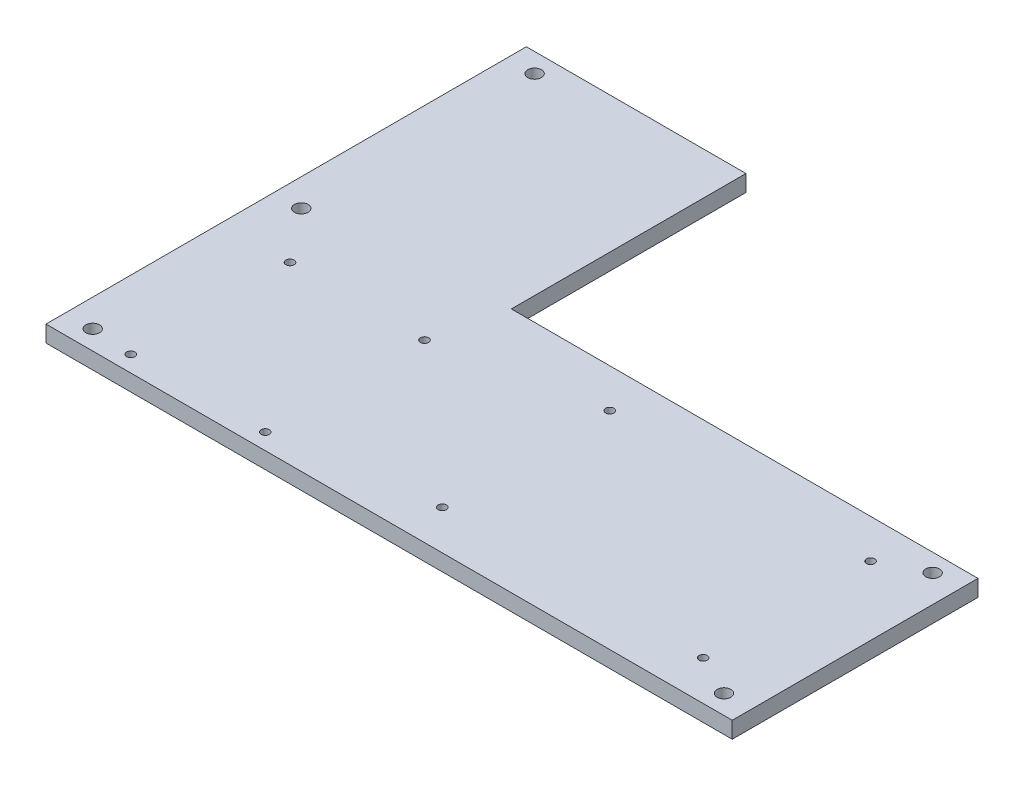
ISO-10303-21;
HEADER;
FILE_DESCRIPTION(('STEP AP214'),'2;1');
FILE_NAME('part.step','',(''),(''),'','','');
FILE_SCHEMA(('AUTOMOTIVE_DESIGN { 1 0 10303 214 1 1 1 1 }'));
ENDSEC;
DATA;
#1=APPLICATION_CONTEXT('core data for automotive mechanical design processes');
#2=APPLICATION_PROTOCOL_DEFINITION('international standard','automotive_design',2000,#1);
#3=PRODUCT_CONTEXT('',#1,'mechanical');
#4=PRODUCT('Part','Part','',(#3));
#5=PRODUCT_RELATED_PRODUCT_CATEGORY('part','',(#4));
#6=PRODUCT_DEFINITION_FORMATION('','',#4);
#7=PRODUCT_DEFINITION_CONTEXT('part definition',#1,'design');
#8=PRODUCT_DEFINITION('design','',#6,#7);
#9=PRODUCT_DEFINITION_SHAPE('','',#8);
#10=(LENGTH_UNIT() NAMED_UNIT(*) SI_UNIT(.MILLI.,.METRE.));
#11=(NAMED_UNIT(*) PLANE_ANGLE_UNIT() SI_UNIT($,.RADIAN.));
#12=(NAMED_UNIT(*) SI_UNIT($,.STERADIAN.) SOLID_ANGLE_UNIT());
#13=UNCERTAINTY_MEASURE_WITH_UNIT(LENGTH_MEASURE(1.E-05),#10,'distance_accuracy_value','');
#14=(GEOMETRIC_REPRESENTATION_CONTEXT(3) GLOBAL_UNCERTAINTY_ASSIGNED_CONTEXT((#13)) GLOBAL_UNIT_ASSIGNED_CONTEXT((#10,
#11,#12)) REPRESENTATION_CONTEXT('',''));
#15=CARTESIAN_POINT('',(0.,0.,0.));
#16=DIRECTION('',(0.,0.,1.));
#17=DIRECTION('',(1.,0.,0.));
#18=AXIS2_PLACEMENT_3D('',#15,#16,#17);
#19=CARTESIAN_POINT('',(-45.3239364575619,6.,-44.6511212594059));
#20=DIRECTION('',(0.,0.,-1.));
#21=DIRECTION('',(-1.,0.,0.));
#22=AXIS2_PLACEMENT_3D('',#19,#20,#21);
#23=PLANE('',#22);
#24=DIRECTION('',(1.,0.,0.));
#25=VECTOR('',#24,1.);
#26=CARTESIAN_POINT('',(-45.3239364575619,0.,-44.6511212594059));
#27=LINE('',#26,#25);
#28=CARTESIAN_POINT('',(-45.3239364575619,0.,-44.6511212594059));
#29=VERTEX_POINT('',#28);
#30=CARTESIAN_POINT('',(124.675630023575,0.,-44.6511212594059));
#31=VERTEX_POINT('',#30);
#32=EDGE_CURVE('E114',#29,#31,#27,.T.);
#33=ORIENTED_EDGE('',*,*,#32,.F.);
#34=DIRECTION('',(0.,-1.,0.));
#35=VECTOR('',#34,1.);
#36=CARTESIAN_POINT('',(-45.3239364575619,6.,-44.6511212594059));
#37=LINE('',#36,#35);
#38=CARTESIAN_POINT('',(-45.3239364575619,6.,-44.6511212594059));
#39=VERTEX_POINT('',#38);
#40=EDGE_CURVE('E11',#39,#29,#37,.T.);
#41=ORIENTED_EDGE('',*,*,#40,.F.);
#42=DIRECTION('',(1.,0.,0.));
#43=VECTOR('',#42,1.);
#44=CARTESIAN_POINT('',(-45.3239364575619,6.,-44.6511212594059));
#45=LINE('',#44,#43);
#46=CARTESIAN_POINT('',(124.675630023575,6.,-44.6511212594059));
#47=VERTEX_POINT('',#46);
#48=EDGE_CURVE('E129',#39,#47,#45,.T.);
#49=ORIENTED_EDGE('',*,*,#48,.T.);
#50=DIRECTION('',(0.,-1.,0.));
#51=VECTOR('',#50,1.);
#52=CARTESIAN_POINT('',(124.675630023575,6.,-44.6511212594059));
#53=LINE('',#52,#51);
#54=EDGE_CURVE('E35',#47,#31,#53,.T.);
#55=ORIENTED_EDGE('',*,*,#54,.T.);
#56=EDGE_LOOP('',(#33,#41,#49,#55));
#57=FACE_BOUND('',#56,.T.);
#58=ADVANCED_FACE('F32',(#57),#23,.T.);
#59=CARTESIAN_POINT('',(-45.323936457562,6.,-130.116695360476));
#60=DIRECTION('',(1.,0.,0.));
#61=DIRECTION('',(0.,0.,-1.));
#62=AXIS2_PLACEMENT_3D('',#59,#60,#61);
#63=PLANE('',#62);
#64=DIRECTION('',(0.,0.,1.));
#65=VECTOR('',#64,1.);
#66=CARTESIAN_POINT('',(-45.323936457562,0.,-130.116695360476));
#67=LINE('',#66,#65);
#68=CARTESIAN_POINT('',(-45.323936457562,0.,-130.116695360476));
#69=VERTEX_POINT('',#68);
#70=EDGE_CURVE('E127',#69,#29,#67,.T.);
#71=ORIENTED_EDGE('',*,*,#70,.F.);
#72=DIRECTION('',(0.,-1.,0.));
#73=VECTOR('',#72,1.);
#74=CARTESIAN_POINT('',(-45.323936457562,6.,-130.116695360476));
#75=LINE('',#74,#73);
#76=CARTESIAN_POINT('',(-45.323936457562,6.,-130.116695360476));
#77=VERTEX_POINT('',#76);
#78=EDGE_CURVE('E41',#77,#69,#75,.T.);
#79=ORIENTED_EDGE('',*,*,#78,.F.);
#80=DIRECTION('',(0.,0.,1.));
#81=VECTOR('',#80,1.);
#82=CARTESIAN_POINT('',(-45.323936457562,6.,-130.116695360476));
#83=LINE('',#82,#81);
#84=EDGE_CURVE('E109',#77,#39,#83,.T.);
#85=ORIENTED_EDGE('',*,*,#84,.T.);
#86=ORIENTED_EDGE('',*,*,#40,.T.);
#87=EDGE_LOOP('',(#71,#79,#85,#86));
#88=FACE_BOUND('',#87,.T.);
#89=ADVANCED_FACE('F138',(#88),#63,.T.);
#90=CARTESIAN_POINT('',(-125.323936457562,6.,-130.116695360476));
#91=DIRECTION('',(0.,0.,-1.));
#92=DIRECTION('',(-1.,0.,0.));
#93=AXIS2_PLACEMENT_3D('',#90,#91,#92);
#94=PLANE('',#93);
#95=DIRECTION('',(1.,0.,0.));
#96=VECTOR('',#95,1.);
#97=CARTESIAN_POINT('',(-125.323936457562,0.,-130.116695360476));
#98=LINE('',#97,#96);
#99=CARTESIAN_POINT('',(-125.323936457562,0.,-130.116695360476));
#100=VERTEX_POINT('',#99);
#101=EDGE_CURVE('E105',#100,#69,#98,.T.);
#102=ORIENTED_EDGE('',*,*,#101,.F.);
#103=DIRECTION('',(0.,-1.,0.));
#104=VECTOR('',#103,1.);
#105=CARTESIAN_POINT('',(-125.323936457562,6.,-130.116695360476));
#106=LINE('',#105,#104);
#107=CARTESIAN_POINT('',(-125.323936457562,6.,-130.116695360476));
#108=VERTEX_POINT('',#107);
#109=EDGE_CURVE('E94',#108,#100,#106,.T.);
#110=ORIENTED_EDGE('',*,*,#109,.F.);
#111=DIRECTION('',(1.,0.,0.));
#112=VECTOR('',#111,1.);
#113=CARTESIAN_POINT('',(-125.323936457562,6.,-130.116695360476));
#114=LINE('',#113,#112);
#115=EDGE_CURVE('E100',#108,#77,#114,.T.);
#116=ORIENTED_EDGE('',*,*,#115,.T.);
#117=ORIENTED_EDGE('',*,*,#78,.T.);
#118=EDGE_LOOP('',(#102,#110,#116,#117));
#119=FACE_BOUND('',#118,.T.);
#120=ADVANCED_FACE('F103',(#119),#94,.T.);
#121=CARTESIAN_POINT('',(-125.323936457562,6.,-45.1166953604762));
#122=DIRECTION('',(-1.,0.,0.));
#123=DIRECTION('',(0.,0.,1.));
#124=AXIS2_PLACEMENT_3D('',#121,#122,#123);
#125=PLANE('',#124);
#126=DIRECTION('',(0.,0.,-1.));
#127=VECTOR('',#126,1.);
#128=CARTESIAN_POINT('',(-125.323936457562,0.,-45.1166953604762));
#129=LINE('',#128,#127);
#130=CARTESIAN_POINT('',(-125.323936457562,0.,44.8833046395238));
#131=VERTEX_POINT('',#130);
#132=EDGE_CURVE('E124',#131,#100,#129,.T.);
#133=ORIENTED_EDGE('',*,*,#132,.F.);
#134=DIRECTION('',(0.,-1.,0.));
#135=VECTOR('',#134,1.);
#136=CARTESIAN_POINT('',(-125.323936457562,6.,44.8833046395238));
#137=LINE('',#136,#135);
#138=CARTESIAN_POINT('',(-125.323936457562,6.,44.8833046395238));
#139=VERTEX_POINT('',#138);
#140=EDGE_CURVE('E96',#139,#131,#137,.T.);
#141=ORIENTED_EDGE('',*,*,#140,.F.);
#142=DIRECTION('',(0.,0.,1.));
#143=VECTOR('',#142,1.);
#144=CARTESIAN_POINT('',(-125.323936457562,6.,-45.1166953604762));
#145=LINE('',#144,#143);
#146=EDGE_CURVE('E91',#108,#139,#145,.T.);
#147=ORIENTED_EDGE('',*,*,#146,.F.);
#148=ORIENTED_EDGE('',*,*,#109,.T.);
#149=EDGE_LOOP('',(#133,#141,#147,#148));
#150=FACE_BOUND('',#149,.T.);
#151=ADVANCED_FACE('F93',(#150),#125,.T.);
#152=CARTESIAN_POINT('',(-125.323936457562,6.,44.8833046395238));
#153=DIRECTION('',(0.,0.,-1.));
#154=DIRECTION('',(-1.,0.,0.));
#155=AXIS2_PLACEMENT_3D('',#152,#153,#154);
#156=PLANE('',#155);
#157=DIRECTION('',(1.,0.,0.));
#158=VECTOR('',#157,1.);
#159=CARTESIAN_POINT('',(-125.323936457562,0.,44.8833046395238));
#160=LINE('',#159,#158);
#161=CARTESIAN_POINT('',(124.675630023575,0.,44.8833046395238));
#162=VERTEX_POINT('',#161);
#163=EDGE_CURVE('E121',#131,#162,#160,.T.);
#164=ORIENTED_EDGE('',*,*,#163,.T.);
#165=DIRECTION('',(0.,-1.,0.));
#166=VECTOR('',#165,1.);
#167=CARTESIAN_POINT('',(124.675630023575,6.,44.8833046395238));
#168=LINE('',#167,#166);
#169=CARTESIAN_POINT('',(124.675630023575,6.,44.8833046395238));
#170=VERTEX_POINT('',#169);
#171=EDGE_CURVE('E132',#170,#162,#168,.T.);
#172=ORIENTED_EDGE('',*,*,#171,.F.);
#173=DIRECTION('',(1.,0.,0.));
#174=VECTOR('',#173,1.);
#175=CARTESIAN_POINT('',(-125.323936457562,6.,44.8833046395238));
#176=LINE('',#175,#174);
#177=EDGE_CURVE('E101',#139,#170,#176,.T.);
#178=ORIENTED_EDGE('',*,*,#177,.F.);
#179=ORIENTED_EDGE('',*,*,#140,.T.);
#180=EDGE_LOOP('',(#164,#172,#178,#179));
#181=FACE_BOUND('',#180,.T.);
#182=ADVANCED_FACE('F151',(#181),#156,.F.);
#183=CARTESIAN_POINT('',(124.675630023575,6.,-44.6511212594059));
#184=DIRECTION('',(1.,0.,0.));
#185=DIRECTION('',(0.,0.,-1.));
#186=AXIS2_PLACEMENT_3D('',#183,#184,#185);
#187=PLANE('',#186);
#188=DIRECTION('',(0.,0.,1.));
#189=VECTOR('',#188,1.);
#190=CARTESIAN_POINT('',(124.675630023575,0.,-44.6511212594059));
#191=LINE('',#190,#189);
#192=EDGE_CURVE('E117',#31,#162,#191,.T.);
#193=ORIENTED_EDGE('',*,*,#192,.F.);
#194=ORIENTED_EDGE('',*,*,#54,.F.);
#195=DIRECTION('',(0.,0.,1.));
#196=VECTOR('',#195,1.);
#197=CARTESIAN_POINT('',(124.675630023575,6.,-44.6511212594059));
#198=LINE('',#197,#196);
#199=EDGE_CURVE('E300',#47,#170,#198,.T.);
#200=ORIENTED_EDGE('',*,*,#199,.T.);
#201=ORIENTED_EDGE('',*,*,#171,.T.);
#202=EDGE_LOOP('',(#193,#194,#200,#201));
#203=FACE_BOUND('',#202,.T.);
#204=ADVANCED_FACE('F134',(#203),#187,.T.);
#205=CARTESIAN_POINT('',(0.,6.,0.));
#206=DIRECTION('',(0.,-1.,0.));
#207=DIRECTION('',(0.,0.,-1.));
#208=AXIS2_PLACEMENT_3D('',#205,#206,#207);
#209=PLANE('',#208);
#210=CARTESIAN_POINT('',(114.675630023575,6.,-38.1166953604762));
#211=DIRECTION('',(0.,1.,0.));
#212=DIRECTION('',(0.,0.,1.));
#213=AXIS2_PLACEMENT_3D('',#210,#211,#212);
#214=CIRCLE('',#213,2.50000000000001);
#215=CARTESIAN_POINT('',(114.675630023575,6.,-35.6166953604762));
#216=VERTEX_POINT('',#215);
#217=EDGE_CURVE('E221',#216,#216,#214,.T.);
#218=ORIENTED_EDGE('',*,*,#217,.F.);
#219=EDGE_LOOP('',(#218));
#220=FACE_BOUND('',#219,.T.);
#221=CARTESIAN_POINT('',(114.675630023575,6.,37.8833046395238));
#222=DIRECTION('',(0.,1.,0.));
#223=DIRECTION('',(0.,0.,1.));
#224=AXIS2_PLACEMENT_3D('',#221,#222,#223);
#225=CIRCLE('',#224,2.5);
#226=CARTESIAN_POINT('',(114.675630023575,6.,40.3833046395238));
#227=VERTEX_POINT('',#226);
#228=EDGE_CURVE('E225',#227,#227,#225,.T.);
#229=ORIENTED_EDGE('',*,*,#228,.F.);
#230=EDGE_LOOP('',(#229));
#231=FACE_BOUND('',#230,.T.);
#232=CARTESIAN_POINT('',(-115.323936457562,6.,37.8833046395238));
#233=DIRECTION('',(0.,1.,0.));
#234=DIRECTION('',(0.,0.,1.));
#235=AXIS2_PLACEMENT_3D('',#232,#233,#234);
#236=CIRCLE('',#235,2.50000000000001);
#237=CARTESIAN_POINT('',(-115.323936457562,6.,40.3833046395238));
#238=VERTEX_POINT('',#237);
#239=EDGE_CURVE('E233',#238,#238,#236,.T.);
#240=ORIENTED_EDGE('',*,*,#239,.F.);
#241=EDGE_LOOP('',(#240));
#242=FACE_BOUND('',#241,.T.);
#243=CARTESIAN_POINT('',(-115.323936457562,6.,-38.1166953604762));
#244=DIRECTION('',(0.,1.,0.));
#245=DIRECTION('',(0.,0.,1.));
#246=AXIS2_PLACEMENT_3D('',#243,#244,#245);
#247=CIRCLE('',#246,2.50000000000001);
#248=CARTESIAN_POINT('',(-115.323936457562,6.,-35.6166953604762));
#249=VERTEX_POINT('',#248);
#250=EDGE_CURVE('E238',#249,#249,#247,.T.);
#251=ORIENTED_EDGE('',*,*,#250,.F.);
#252=EDGE_LOOP('',(#251));
#253=FACE_BOUND('',#252,.T.);
#254=CARTESIAN_POINT('',(4.67563002357504,6.,30.5));
#255=DIRECTION('',(0.,1.,0.));
#256=DIRECTION('',(0.,0.,1.));
#257=AXIS2_PLACEMENT_3D('',#254,#255,#256);
#258=CIRCLE('',#257,1.5);
#259=CARTESIAN_POINT('',(4.67563002357504,6.,32.));
#260=VERTEX_POINT('',#259);
#261=EDGE_CURVE('E244',#260,#260,#258,.T.);
#262=ORIENTED_EDGE('',*,*,#261,.F.);
#263=EDGE_LOOP('',(#262));
#264=FACE_BOUND('',#263,.T.);
#265=CARTESIAN_POINT('',(99.6756300235751,6.,30.5));
#266=DIRECTION('',(0.,1.,0.));
#267=DIRECTION('',(0.,0.,1.));
#268=AXIS2_PLACEMENT_3D('',#265,#266,#267);
#269=CIRCLE('',#268,1.5);
#270=CARTESIAN_POINT('',(99.6756300235751,6.,32.));
#271=VERTEX_POINT('',#270);
#272=EDGE_CURVE('E250',#271,#271,#269,.T.);
#273=ORIENTED_EDGE('',*,*,#272,.F.);
#274=EDGE_LOOP('',(#273));
#275=FACE_BOUND('',#274,.T.);
#276=CARTESIAN_POINT('',(99.6756300235751,6.,-30.5));
#277=DIRECTION('',(0.,1.,0.));
#278=DIRECTION('',(0.,0.,1.));
#279=AXIS2_PLACEMENT_3D('',#276,#277,#278);
#280=CIRCLE('',#279,1.5);
#281=CARTESIAN_POINT('',(99.6756300235751,6.,-29.));
#282=VERTEX_POINT('',#281);
#283=EDGE_CURVE('E256',#282,#282,#280,.T.);
#284=ORIENTED_EDGE('',*,*,#283,.F.);
#285=EDGE_LOOP('',(#284));
#286=FACE_BOUND('',#285,.T.);
#287=CARTESIAN_POINT('',(4.67563002357504,6.,-30.5));
#288=DIRECTION('',(0.,1.,0.));
#289=DIRECTION('',(0.,0.,1.));
#290=AXIS2_PLACEMENT_3D('',#287,#288,#289);
#291=CIRCLE('',#290,1.5);
#292=CARTESIAN_POINT('',(4.67563002357504,6.,-29.));
#293=VERTEX_POINT('',#292);
#294=EDGE_CURVE('E265',#293,#293,#291,.T.);
#295=ORIENTED_EDGE('',*,*,#294,.F.);
#296=EDGE_LOOP('',(#295));
#297=FACE_BOUND('',#296,.T.);
#298=CARTESIAN_POINT('',(-115.323936457562,6.,-123.116695360476));
#299=DIRECTION('',(0.,1.,0.));
#300=DIRECTION('',(0.,0.,1.));
#301=AXIS2_PLACEMENT_3D('',#298,#299,#300);
#302=CIRCLE('',#301,2.50000000000001);
#303=CARTESIAN_POINT('',(-115.323936457562,6.,-120.616695360476));
#304=VERTEX_POINT('',#303);
#305=EDGE_CURVE('E268',#304,#304,#302,.T.);
#306=ORIENTED_EDGE('',*,*,#305,.F.);
#307=EDGE_LOOP('',(#306));
#308=FACE_BOUND('',#307,.T.);
#309=CARTESIAN_POINT('',(-100.323936457562,6.,-19.));
#310=DIRECTION('',(0.,1.,0.));
#311=DIRECTION('',(0.,0.,1.));
#312=AXIS2_PLACEMENT_3D('',#309,#310,#311);
#313=CIRCLE('',#312,1.5);
#314=CARTESIAN_POINT('',(-100.323936457562,6.,-17.5));
#315=VERTEX_POINT('',#314);
#316=EDGE_CURVE('E274',#315,#315,#313,.T.);
#317=ORIENTED_EDGE('',*,*,#316,.F.);
#318=EDGE_LOOP('',(#317));
#319=FACE_BOUND('',#318,.T.);
#320=CARTESIAN_POINT('',(-51.3239364575619,6.,-19.));
#321=DIRECTION('',(0.,1.,0.));
#322=DIRECTION('',(0.,0.,1.));
#323=AXIS2_PLACEMENT_3D('',#320,#321,#322);
#324=CIRCLE('',#323,1.5);
#325=CARTESIAN_POINT('',(-51.3239364575619,6.,-17.5));
#326=VERTEX_POINT('',#325);
#327=EDGE_CURVE('E280',#326,#326,#324,.T.);
#328=ORIENTED_EDGE('',*,*,#327,.F.);
#329=EDGE_LOOP('',(#328));
#330=FACE_BOUND('',#329,.T.);
#331=CARTESIAN_POINT('',(-51.3239364575619,6.,39.));
#332=DIRECTION('',(0.,1.,0.));
#333=DIRECTION('',(0.,0.,1.));
#334=AXIS2_PLACEMENT_3D('',#331,#332,#333);
#335=CIRCLE('',#334,1.5);
#336=CARTESIAN_POINT('',(-51.3239364575619,6.,40.5));
#337=VERTEX_POINT('',#336);
#338=EDGE_CURVE('E286',#337,#337,#335,.T.);
#339=ORIENTED_EDGE('',*,*,#338,.F.);
#340=EDGE_LOOP('',(#339));
#341=FACE_BOUND('',#340,.T.);
#342=CARTESIAN_POINT('',(-100.323936457562,6.,39.));
#343=DIRECTION('',(0.,1.,0.));
#344=DIRECTION('',(0.,0.,1.));
#345=AXIS2_PLACEMENT_3D('',#342,#343,#344);
#346=CIRCLE('',#345,1.5);
#347=CARTESIAN_POINT('',(-100.323936457562,6.,40.5));
#348=VERTEX_POINT('',#347);
#349=EDGE_CURVE('E118',#348,#348,#346,.T.);
#350=ORIENTED_EDGE('',*,*,#349,.F.);
#351=EDGE_LOOP('',(#350));
#352=FACE_BOUND('',#351,.T.);
#353=ORIENTED_EDGE('',*,*,#48,.F.);
#354=ORIENTED_EDGE('',*,*,#84,.F.);
#355=ORIENTED_EDGE('',*,*,#115,.F.);
#356=ORIENTED_EDGE('',*,*,#146,.T.);
#357=ORIENTED_EDGE('',*,*,#177,.T.);
#358=ORIENTED_EDGE('',*,*,#199,.F.);
#359=EDGE_LOOP('',(#353,#354,#355,#356,#357,#358));
#360=FACE_BOUND('',#359,.T.);
#361=ADVANCED_FACE('F108',(#220,#231,#242,#253,#264,#275,#286,#297,#308,#319,#330,#341,#352,
#360),#209,.F.);
#362=CARTESIAN_POINT('',(0.,0.,0.));
#363=DIRECTION('',(0.,-1.,0.));
#364=DIRECTION('',(0.,0.,-1.));
#365=AXIS2_PLACEMENT_3D('',#362,#363,#364);
#366=PLANE('',#365);
#367=CARTESIAN_POINT('',(114.675630023575,0.,-38.1166953604762));
#368=DIRECTION('',(0.,1.,0.));
#369=DIRECTION('',(0.,0.,1.));
#370=AXIS2_PLACEMENT_3D('',#367,#368,#369);
#371=CIRCLE('',#370,2.50000000000001);
#372=CARTESIAN_POINT('',(114.675630023575,0.,-35.6166953604762));
#373=VERTEX_POINT('',#372);
#374=EDGE_CURVE('E224',#373,#373,#371,.T.);
#375=ORIENTED_EDGE('',*,*,#374,.T.);
#376=EDGE_LOOP('',(#375));
#377=FACE_BOUND('',#376,.T.);
#378=CARTESIAN_POINT('',(114.675630023575,0.,37.8833046395238));
#379=DIRECTION('',(0.,1.,0.));
#380=DIRECTION('',(0.,0.,1.));
#381=AXIS2_PLACEMENT_3D('',#378,#379,#380);
#382=CIRCLE('',#381,2.5);
#383=CARTESIAN_POINT('',(114.675630023575,0.,40.3833046395238));
#384=VERTEX_POINT('',#383);
#385=EDGE_CURVE('E228',#384,#384,#382,.T.);
#386=ORIENTED_EDGE('',*,*,#385,.T.);
#387=EDGE_LOOP('',(#386));
#388=FACE_BOUND('',#387,.T.);
#389=CARTESIAN_POINT('',(-115.323936457562,0.,37.8833046395238));
#390=DIRECTION('',(0.,1.,0.));
#391=DIRECTION('',(0.,0.,1.));
#392=AXIS2_PLACEMENT_3D('',#389,#390,#391);
#393=CIRCLE('',#392,2.50000000000001);
#394=CARTESIAN_POINT('',(-115.323936457562,0.,40.3833046395238));
#395=VERTEX_POINT('',#394);
#396=EDGE_CURVE('E235',#395,#395,#393,.T.);
#397=ORIENTED_EDGE('',*,*,#396,.T.);
#398=EDGE_LOOP('',(#397));
#399=FACE_BOUND('',#398,.T.);
#400=CARTESIAN_POINT('',(-115.323936457562,0.,-38.1166953604762));
#401=DIRECTION('',(0.,1.,0.));
#402=DIRECTION('',(0.,0.,1.));
#403=AXIS2_PLACEMENT_3D('',#400,#401,#402);
#404=CIRCLE('',#403,2.50000000000001);
#405=CARTESIAN_POINT('',(-115.323936457562,0.,-35.6166953604762));
#406=VERTEX_POINT('',#405);
#407=EDGE_CURVE('E241',#406,#406,#404,.T.);
#408=ORIENTED_EDGE('',*,*,#407,.T.);
#409=EDGE_LOOP('',(#408));
#410=FACE_BOUND('',#409,.T.);
#411=CARTESIAN_POINT('',(4.67563002357504,0.,30.5));
#412=DIRECTION('',(0.,1.,0.));
#413=DIRECTION('',(0.,0.,1.));
#414=AXIS2_PLACEMENT_3D('',#411,#412,#413);
#415=CIRCLE('',#414,1.5);
#416=CARTESIAN_POINT('',(4.67563002357504,0.,32.));
#417=VERTEX_POINT('',#416);
#418=EDGE_CURVE('E247',#417,#417,#415,.T.);
#419=ORIENTED_EDGE('',*,*,#418,.T.);
#420=EDGE_LOOP('',(#419));
#421=FACE_BOUND('',#420,.T.);
#422=CARTESIAN_POINT('',(99.6756300235751,0.,30.5));
#423=DIRECTION('',(0.,1.,0.));
#424=DIRECTION('',(0.,0.,1.));
#425=AXIS2_PLACEMENT_3D('',#422,#423,#424);
#426=CIRCLE('',#425,1.5);
#427=CARTESIAN_POINT('',(99.6756300235751,0.,32.));
#428=VERTEX_POINT('',#427);
#429=EDGE_CURVE('E253',#428,#428,#426,.T.);
#430=ORIENTED_EDGE('',*,*,#429,.T.);
#431=EDGE_LOOP('',(#430));
#432=FACE_BOUND('',#431,.T.);
#433=CARTESIAN_POINT('',(99.6756300235751,0.,-30.5));
#434=DIRECTION('',(0.,1.,0.));
#435=DIRECTION('',(0.,0.,1.));
#436=AXIS2_PLACEMENT_3D('',#433,#434,#435);
#437=CIRCLE('',#436,1.5);
#438=CARTESIAN_POINT('',(99.6756300235751,0.,-29.));
#439=VERTEX_POINT('',#438);
#440=EDGE_CURVE('E259',#439,#439,#437,.T.);
#441=ORIENTED_EDGE('',*,*,#440,.T.);
#442=EDGE_LOOP('',(#441));
#443=FACE_BOUND('',#442,.T.);
#444=CARTESIAN_POINT('',(4.67563002357504,0.,-30.5));
#445=DIRECTION('',(0.,1.,0.));
#446=DIRECTION('',(0.,0.,1.));
#447=AXIS2_PLACEMENT_3D('',#444,#445,#446);
#448=CIRCLE('',#447,1.5);
#449=CARTESIAN_POINT('',(4.67563002357504,0.,-29.));
#450=VERTEX_POINT('',#449);
#451=EDGE_CURVE('E262',#450,#450,#448,.T.);
#452=ORIENTED_EDGE('',*,*,#451,.T.);
#453=EDGE_LOOP('',(#452));
#454=FACE_BOUND('',#453,.T.);
#455=CARTESIAN_POINT('',(-115.323936457562,0.,-123.116695360476));
#456=DIRECTION('',(0.,1.,0.));
#457=DIRECTION('',(0.,0.,1.));
#458=AXIS2_PLACEMENT_3D('',#455,#456,#457);
#459=CIRCLE('',#458,2.50000000000001);
#460=CARTESIAN_POINT('',(-115.323936457562,0.,-120.616695360476));
#461=VERTEX_POINT('',#460);
#462=EDGE_CURVE('E271',#461,#461,#459,.T.);
#463=ORIENTED_EDGE('',*,*,#462,.T.);
#464=EDGE_LOOP('',(#463));
#465=FACE_BOUND('',#464,.T.);
#466=CARTESIAN_POINT('',(-100.323936457562,0.,-19.));
#467=DIRECTION('',(0.,1.,0.));
#468=DIRECTION('',(0.,0.,1.));
#469=AXIS2_PLACEMENT_3D('',#466,#467,#468);
#470=CIRCLE('',#469,1.5);
#471=CARTESIAN_POINT('',(-100.323936457562,0.,-17.5));
#472=VERTEX_POINT('',#471);
#473=EDGE_CURVE('E277',#472,#472,#470,.T.);
#474=ORIENTED_EDGE('',*,*,#473,.T.);
#475=EDGE_LOOP('',(#474));
#476=FACE_BOUND('',#475,.T.);
#477=CARTESIAN_POINT('',(-51.3239364575619,0.,-19.));
#478=DIRECTION('',(0.,1.,0.));
#479=DIRECTION('',(0.,0.,1.));
#480=AXIS2_PLACEMENT_3D('',#477,#478,#479);
#481=CIRCLE('',#480,1.5);
#482=CARTESIAN_POINT('',(-51.3239364575619,0.,-17.5));
#483=VERTEX_POINT('',#482);
#484=EDGE_CURVE('E283',#483,#483,#481,.T.);
#485=ORIENTED_EDGE('',*,*,#484,.T.);
#486=EDGE_LOOP('',(#485));
#487=FACE_BOUND('',#486,.T.);
#488=CARTESIAN_POINT('',(-51.3239364575619,0.,39.));
#489=DIRECTION('',(0.,1.,0.));
#490=DIRECTION('',(0.,0.,1.));
#491=AXIS2_PLACEMENT_3D('',#488,#489,#490);
#492=CIRCLE('',#491,1.5);
#493=CARTESIAN_POINT('',(-51.3239364575619,0.,40.5));
#494=VERTEX_POINT('',#493);
#495=EDGE_CURVE('E289',#494,#494,#492,.T.);
#496=ORIENTED_EDGE('',*,*,#495,.T.);
#497=EDGE_LOOP('',(#496));
#498=FACE_BOUND('',#497,.T.);
#499=CARTESIAN_POINT('',(-100.323936457562,0.,39.));
#500=DIRECTION('',(0.,1.,0.));
#501=DIRECTION('',(0.,0.,1.));
#502=AXIS2_PLACEMENT_3D('',#499,#500,#501);
#503=CIRCLE('',#502,1.5);
#504=CARTESIAN_POINT('',(-100.323936457562,0.,40.5));
#505=VERTEX_POINT('',#504);
#506=EDGE_CURVE('E292',#505,#505,#503,.T.);
#507=ORIENTED_EDGE('',*,*,#506,.T.);
#508=EDGE_LOOP('',(#507));
#509=FACE_BOUND('',#508,.T.);
#510=ORIENTED_EDGE('',*,*,#32,.T.);
#511=ORIENTED_EDGE('',*,*,#192,.T.);
#512=ORIENTED_EDGE('',*,*,#163,.F.);
#513=ORIENTED_EDGE('',*,*,#132,.T.);
#514=ORIENTED_EDGE('',*,*,#101,.T.);
#515=ORIENTED_EDGE('',*,*,#70,.T.);
#516=EDGE_LOOP('',(#510,#511,#512,#513,#514,#515));
#517=FACE_BOUND('',#516,.T.);
#518=ADVANCED_FACE('F137',(#377,#388,#399,#410,#421,#432,#443,#454,#465,#476,#487,#498,#509,
#517),#366,.T.);
#519=CARTESIAN_POINT('',(-100.323936457562,6.,39.));
#520=DIRECTION('',(0.,-1.,0.));
#521=DIRECTION('',(0.,0.,-1.));
#522=AXIS2_PLACEMENT_3D('',#519,#520,#521);
#523=CYLINDRICAL_SURFACE('',#522,1.5);
#524=ORIENTED_EDGE('',*,*,#349,.T.);
#525=EDGE_LOOP('',(#524));
#526=FACE_BOUND('',#525,.T.);
#527=ORIENTED_EDGE('',*,*,#506,.F.);
#528=EDGE_LOOP('',(#527));
#529=FACE_BOUND('',#528,.T.);
#530=ADVANCED_FACE('F162',(#526,#529),#523,.F.);
#531=CARTESIAN_POINT('',(-51.3239364575619,6.,39.));
#532=DIRECTION('',(0.,-1.,0.));
#533=DIRECTION('',(0.,0.,-1.));
#534=AXIS2_PLACEMENT_3D('',#531,#532,#533);
#535=CYLINDRICAL_SURFACE('',#534,1.5);
#536=ORIENTED_EDGE('',*,*,#338,.T.);
#537=EDGE_LOOP('',(#536));
#538=FACE_BOUND('',#537,.T.);
#539=ORIENTED_EDGE('',*,*,#495,.F.);
#540=EDGE_LOOP('',(#539));
#541=FACE_BOUND('',#540,.T.);
#542=ADVANCED_FACE('F169',(#538,#541),#535,.F.);
#543=CARTESIAN_POINT('',(-51.3239364575619,6.,-19.));
#544=DIRECTION('',(0.,-1.,0.));
#545=DIRECTION('',(0.,0.,-1.));
#546=AXIS2_PLACEMENT_3D('',#543,#544,#545);
#547=CYLINDRICAL_SURFACE('',#546,1.5);
#548=ORIENTED_EDGE('',*,*,#327,.T.);
#549=EDGE_LOOP('',(#548));
#550=FACE_BOUND('',#549,.T.);
#551=ORIENTED_EDGE('',*,*,#484,.F.);
#552=EDGE_LOOP('',(#551));
#553=FACE_BOUND('',#552,.T.);
#554=ADVANCED_FACE('F173',(#550,#553),#547,.F.);
#555=CARTESIAN_POINT('',(-100.323936457562,6.,-19.));
#556=DIRECTION('',(0.,-1.,0.));
#557=DIRECTION('',(0.,0.,-1.));
#558=AXIS2_PLACEMENT_3D('',#555,#556,#557);
#559=CYLINDRICAL_SURFACE('',#558,1.5);
#560=ORIENTED_EDGE('',*,*,#316,.T.);
#561=EDGE_LOOP('',(#560));
#562=FACE_BOUND('',#561,.T.);
#563=ORIENTED_EDGE('',*,*,#473,.F.);
#564=EDGE_LOOP('',(#563));
#565=FACE_BOUND('',#564,.T.);
#566=ADVANCED_FACE('F177',(#562,#565),#559,.F.);
#567=CARTESIAN_POINT('',(-115.323936457562,6.,-123.116695360476));
#568=DIRECTION('',(0.,-1.,0.));
#569=DIRECTION('',(0.,0.,-1.));
#570=AXIS2_PLACEMENT_3D('',#567,#568,#569);
#571=CYLINDRICAL_SURFACE('',#570,2.50000000000001);
#572=ORIENTED_EDGE('',*,*,#305,.T.);
#573=EDGE_LOOP('',(#572));
#574=FACE_BOUND('',#573,.T.);
#575=ORIENTED_EDGE('',*,*,#462,.F.);
#576=EDGE_LOOP('',(#575));
#577=FACE_BOUND('',#576,.T.);
#578=ADVANCED_FACE('F181',(#574,#577),#571,.F.);
#579=CARTESIAN_POINT('',(4.67563002357504,6.,-30.5));
#580=DIRECTION('',(0.,-1.,0.));
#581=DIRECTION('',(0.,0.,-1.));
#582=AXIS2_PLACEMENT_3D('',#579,#580,#581);
#583=CYLINDRICAL_SURFACE('',#582,1.5);
#584=ORIENTED_EDGE('',*,*,#294,.T.);
#585=EDGE_LOOP('',(#584));
#586=FACE_BOUND('',#585,.T.);
#587=ORIENTED_EDGE('',*,*,#451,.F.);
#588=EDGE_LOOP('',(#587));
#589=FACE_BOUND('',#588,.T.);
#590=ADVANCED_FACE('F185',(#586,#589),#583,.F.);
#591=CARTESIAN_POINT('',(99.6756300235751,6.,-30.5));
#592=DIRECTION('',(0.,-1.,0.));
#593=DIRECTION('',(0.,0.,-1.));
#594=AXIS2_PLACEMENT_3D('',#591,#592,#593);
#595=CYLINDRICAL_SURFACE('',#594,1.5);
#596=ORIENTED_EDGE('',*,*,#283,.T.);
#597=EDGE_LOOP('',(#596));
#598=FACE_BOUND('',#597,.T.);
#599=ORIENTED_EDGE('',*,*,#440,.F.);
#600=EDGE_LOOP('',(#599));
#601=FACE_BOUND('',#600,.T.);
#602=ADVANCED_FACE('F189',(#598,#601),#595,.F.);
#603=CARTESIAN_POINT('',(99.6756300235751,6.,30.5));
#604=DIRECTION('',(0.,-1.,0.));
#605=DIRECTION('',(0.,0.,-1.));
#606=AXIS2_PLACEMENT_3D('',#603,#604,#605);
#607=CYLINDRICAL_SURFACE('',#606,1.5);
#608=ORIENTED_EDGE('',*,*,#272,.T.);
#609=EDGE_LOOP('',(#608));
#610=FACE_BOUND('',#609,.T.);
#611=ORIENTED_EDGE('',*,*,#429,.F.);
#612=EDGE_LOOP('',(#611));
#613=FACE_BOUND('',#612,.T.);
#614=ADVANCED_FACE('F193',(#610,#613),#607,.F.);
#615=CARTESIAN_POINT('',(4.67563002357504,6.,30.5));
#616=DIRECTION('',(0.,-1.,0.));
#617=DIRECTION('',(0.,0.,-1.));
#618=AXIS2_PLACEMENT_3D('',#615,#616,#617);
#619=CYLINDRICAL_SURFACE('',#618,1.5);
#620=ORIENTED_EDGE('',*,*,#261,.T.);
#621=EDGE_LOOP('',(#620));
#622=FACE_BOUND('',#621,.T.);
#623=ORIENTED_EDGE('',*,*,#418,.F.);
#624=EDGE_LOOP('',(#623));
#625=FACE_BOUND('',#624,.T.);
#626=ADVANCED_FACE('F197',(#622,#625),#619,.F.);
#627=CARTESIAN_POINT('',(-115.323936457562,6.,-38.1166953604762));
#628=DIRECTION('',(0.,-1.,0.));
#629=DIRECTION('',(0.,0.,-1.));
#630=AXIS2_PLACEMENT_3D('',#627,#628,#629);
#631=CYLINDRICAL_SURFACE('',#630,2.50000000000001);
#632=ORIENTED_EDGE('',*,*,#250,.T.);
#633=EDGE_LOOP('',(#632));
#634=FACE_BOUND('',#633,.T.);
#635=ORIENTED_EDGE('',*,*,#407,.F.);
#636=EDGE_LOOP('',(#635));
#637=FACE_BOUND('',#636,.T.);
#638=ADVANCED_FACE('F201',(#634,#637),#631,.F.);
#639=CARTESIAN_POINT('',(-115.323936457562,6.,37.8833046395238));
#640=DIRECTION('',(0.,-1.,0.));
#641=DIRECTION('',(0.,0.,-1.));
#642=AXIS2_PLACEMENT_3D('',#639,#640,#641);
#643=CYLINDRICAL_SURFACE('',#642,2.50000000000001);
#644=ORIENTED_EDGE('',*,*,#239,.T.);
#645=EDGE_LOOP('',(#644));
#646=FACE_BOUND('',#645,.T.);
#647=ORIENTED_EDGE('',*,*,#396,.F.);
#648=EDGE_LOOP('',(#647));
#649=FACE_BOUND('',#648,.T.);
#650=ADVANCED_FACE('F205',(#646,#649),#643,.F.);
#651=CARTESIAN_POINT('',(114.675630023575,6.,37.8833046395238));
#652=DIRECTION('',(0.,-1.,0.));
#653=DIRECTION('',(0.,0.,-1.));
#654=AXIS2_PLACEMENT_3D('',#651,#652,#653);
#655=CYLINDRICAL_SURFACE('',#654,2.5);
#656=ORIENTED_EDGE('',*,*,#228,.T.);
#657=EDGE_LOOP('',(#656));
#658=FACE_BOUND('',#657,.T.);
#659=ORIENTED_EDGE('',*,*,#385,.F.);
#660=EDGE_LOOP('',(#659));
#661=FACE_BOUND('',#660,.T.);
#662=ADVANCED_FACE('F209',(#658,#661),#655,.F.);
#663=CARTESIAN_POINT('',(114.675630023575,6.,-38.1166953604762));
#664=DIRECTION('',(0.,-1.,0.));
#665=DIRECTION('',(0.,0.,-1.));
#666=AXIS2_PLACEMENT_3D('',#663,#664,#665);
#667=CYLINDRICAL_SURFACE('',#666,2.50000000000001);
#668=ORIENTED_EDGE('',*,*,#217,.T.);
#669=EDGE_LOOP('',(#668));
#670=FACE_BOUND('',#669,.T.);
#671=ORIENTED_EDGE('',*,*,#374,.F.);
#672=EDGE_LOOP('',(#671));
#673=FACE_BOUND('',#672,.T.);
#674=ADVANCED_FACE('F213',(#670,#673),#667,.F.);
#675=CLOSED_SHELL('',(#58,#89,#120,#151,#182,#204,#361,#518,#530,#542,#554,#566,#578,#590,#602,
#614,#626,#638,#650,#662,#674));
#676=MANIFOLD_SOLID_BREP('B2',#675);
#677=ADVANCED_BREP_SHAPE_REPRESENTATION('',(#18,#676),#14);
#678=SHAPE_DEFINITION_REPRESENTATION(#9,#677);
ENDSEC;
END-ISO-10303-21;
